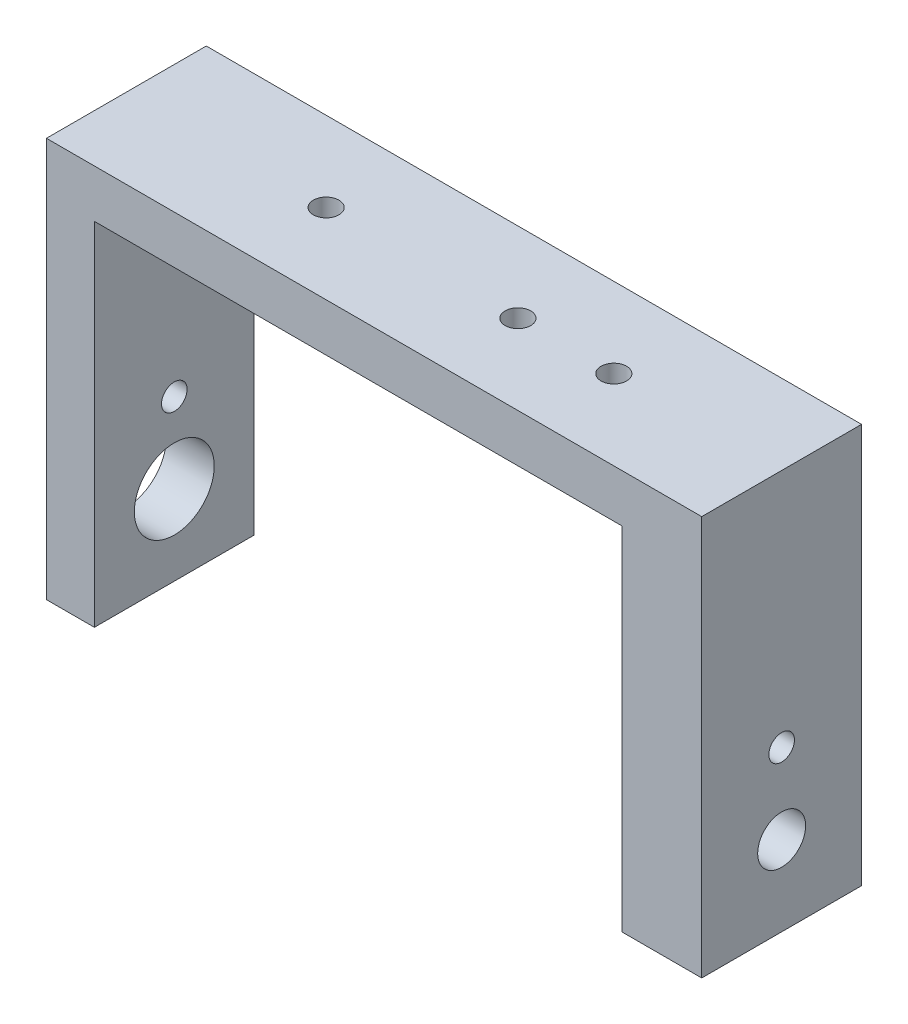
ISO-10303-21;
HEADER;
FILE_DESCRIPTION(('STEP AP214'),'2;1');
FILE_NAME('part.step','',(''),(''),'','','');
FILE_SCHEMA(('AUTOMOTIVE_DESIGN { 1 0 10303 214 1 1 1 1 }'));
ENDSEC;
DATA;
#1=APPLICATION_CONTEXT('core data for automotive mechanical design processes');
#2=APPLICATION_PROTOCOL_DEFINITION('international standard','automotive_design',2000,#1);
#3=PRODUCT_CONTEXT('',#1,'mechanical');
#4=PRODUCT('Part','Part','',(#3));
#5=PRODUCT_RELATED_PRODUCT_CATEGORY('part','',(#4));
#6=PRODUCT_DEFINITION_FORMATION('','',#4);
#7=PRODUCT_DEFINITION_CONTEXT('part definition',#1,'design');
#8=PRODUCT_DEFINITION('design','',#6,#7);
#9=PRODUCT_DEFINITION_SHAPE('','',#8);
#10=(LENGTH_UNIT() NAMED_UNIT(*) SI_UNIT(.MILLI.,.METRE.));
#11=(NAMED_UNIT(*) PLANE_ANGLE_UNIT() SI_UNIT($,.RADIAN.));
#12=(NAMED_UNIT(*) SI_UNIT($,.STERADIAN.) SOLID_ANGLE_UNIT());
#13=UNCERTAINTY_MEASURE_WITH_UNIT(LENGTH_MEASURE(1.E-05),#10,'distance_accuracy_value','');
#14=(GEOMETRIC_REPRESENTATION_CONTEXT(3) GLOBAL_UNCERTAINTY_ASSIGNED_CONTEXT((#13)) GLOBAL_UNIT_ASSIGNED_CONTEXT((#10,
#11,#12)) REPRESENTATION_CONTEXT('',''));
#15=CARTESIAN_POINT('',(0.,0.,0.));
#16=DIRECTION('',(0.,0.,1.));
#17=DIRECTION('',(1.,0.,0.));
#18=AXIS2_PLACEMENT_3D('',#15,#16,#17);
#19=CARTESIAN_POINT('',(16.5,-11.,10.));
#20=DIRECTION('',(1.,0.,0.));
#21=DIRECTION('',(0.,0.,-1.));
#22=AXIS2_PLACEMENT_3D('',#19,#20,#21);
#23=PLANE('',#22);
#24=DIRECTION('',(0.,0.,-1.));
#25=VECTOR('',#24,1.);
#26=CARTESIAN_POINT('',(16.5,-11.,10.));
#27=LINE('',#26,#25);
#28=CARTESIAN_POINT('',(16.5,-11.,1.));
#29=VERTEX_POINT('',#28);
#30=CARTESIAN_POINT('',(16.5,-11.,0.));
#31=VERTEX_POINT('',#30);
#32=EDGE_CURVE('E169',#29,#31,#27,.T.);
#33=ORIENTED_EDGE('',*,*,#32,.F.);
#34=DIRECTION('',(0.,-1.,0.));
#35=VECTOR('',#34,1.);
#36=CARTESIAN_POINT('',(16.5,-0.999999999999996,0.999999999999999));
#37=LINE('',#36,#35);
#38=CARTESIAN_POINT('',(16.5,-0.999999999999996,0.999999999999999));
#39=VERTEX_POINT('',#38);
#40=EDGE_CURVE('E262',#39,#29,#37,.T.);
#41=ORIENTED_EDGE('',*,*,#40,.F.);
#42=DIRECTION('',(0.,-0.988371697650617,-0.152057184253941));
#43=VECTOR('',#42,1.);
#44=CARTESIAN_POINT('',(16.5,12.,3.));
#45=LINE('',#44,#43);
#46=CARTESIAN_POINT('',(16.5,11.,2.84615384615384));
#47=VERTEX_POINT('',#46);
#48=EDGE_CURVE('E187',#47,#39,#45,.T.);
#49=ORIENTED_EDGE('',*,*,#48,.F.);
#50=DIRECTION('',(0.,0.,-1.));
#51=VECTOR('',#50,1.);
#52=CARTESIAN_POINT('',(16.5,11.,10.));
#53=LINE('',#52,#51);
#54=CARTESIAN_POINT('',(16.5,11.,0.));
#55=VERTEX_POINT('',#54);
#56=EDGE_CURVE('E173',#47,#55,#53,.T.);
#57=ORIENTED_EDGE('',*,*,#56,.T.);
#58=DIRECTION('',(0.,-1.,0.));
#59=VECTOR('',#58,1.);
#60=CARTESIAN_POINT('',(16.5,-11.,0.));
#61=LINE('',#60,#59);
#62=EDGE_CURVE('E151',#55,#31,#61,.T.);
#63=ORIENTED_EDGE('',*,*,#62,.T.);
#64=EDGE_LOOP('',(#33,#41,#49,#57,#63));
#65=FACE_BOUND('',#64,.T.);
#66=ADVANCED_FACE('F35',(#65),#23,.F.);
#67=CARTESIAN_POINT('',(-16.5,11.,10.));
#68=DIRECTION('',(-1.,0.,0.));
#69=DIRECTION('',(0.,0.,1.));
#70=AXIS2_PLACEMENT_3D('',#67,#68,#69);
#71=PLANE('',#70);
#72=CARTESIAN_POINT('',(-16.5,-6.,5.));
#73=DIRECTION('',(-1.,0.,0.));
#74=DIRECTION('',(0.,0.,1.));
#75=AXIS2_PLACEMENT_3D('',#72,#73,#74);
#76=CIRCLE('',#75,2.5);
#77=CARTESIAN_POINT('',(-16.5,-6.,7.5));
#78=VERTEX_POINT('',#77);
#79=EDGE_CURVE('E279',#78,#78,#76,.T.);
#80=ORIENTED_EDGE('',*,*,#79,.T.);
#81=EDGE_LOOP('',(#80));
#82=FACE_BOUND('',#81,.T.);
#83=CARTESIAN_POINT('',(-16.5,-0.999999999999994,5.));
#84=DIRECTION('',(-1.,0.,0.));
#85=DIRECTION('',(0.,0.,1.));
#86=AXIS2_PLACEMENT_3D('',#83,#84,#85);
#87=CIRCLE('',#86,0.800000000000001);
#88=CARTESIAN_POINT('',(-16.5,-0.999999999999994,5.8));
#89=VERTEX_POINT('',#88);
#90=EDGE_CURVE('E212',#89,#89,#87,.T.);
#91=ORIENTED_EDGE('',*,*,#90,.T.);
#92=EDGE_LOOP('',(#91));
#93=FACE_BOUND('',#92,.T.);
#94=DIRECTION('',(0.,1.,0.));
#95=VECTOR('',#94,1.);
#96=CARTESIAN_POINT('',(-16.5,11.,0.));
#97=LINE('',#96,#95);
#98=CARTESIAN_POINT('',(-16.5,-11.,0.));
#99=VERTEX_POINT('',#98);
#100=CARTESIAN_POINT('',(-16.5,11.,0.));
#101=VERTEX_POINT('',#100);
#102=EDGE_CURVE('E144',#99,#101,#97,.T.);
#103=ORIENTED_EDGE('',*,*,#102,.T.);
#104=DIRECTION('',(0.,0.,-1.));
#105=VECTOR('',#104,1.);
#106=CARTESIAN_POINT('',(-16.5,11.,10.));
#107=LINE('',#106,#105);
#108=CARTESIAN_POINT('',(-16.5,11.,10.));
#109=VERTEX_POINT('',#108);
#110=EDGE_CURVE('E11',#109,#101,#107,.T.);
#111=ORIENTED_EDGE('',*,*,#110,.F.);
#112=DIRECTION('',(0.,1.,0.));
#113=VECTOR('',#112,1.);
#114=CARTESIAN_POINT('',(-16.5,11.,10.));
#115=LINE('',#114,#113);
#116=CARTESIAN_POINT('',(-16.5,-11.,10.));
#117=VERTEX_POINT('',#116);
#118=EDGE_CURVE('E162',#117,#109,#115,.T.);
#119=ORIENTED_EDGE('',*,*,#118,.F.);
#120=DIRECTION('',(0.,0.,-1.));
#121=VECTOR('',#120,1.);
#122=CARTESIAN_POINT('',(-16.5,-11.,10.));
#123=LINE('',#122,#121);
#124=EDGE_CURVE('E140',#117,#99,#123,.T.);
#125=ORIENTED_EDGE('',*,*,#124,.T.);
#126=EDGE_LOOP('',(#103,#111,#119,#125));
#127=FACE_BOUND('',#126,.T.);
#128=ADVANCED_FACE('F37',(#82,#93,#127),#71,.F.);
#129=CARTESIAN_POINT('',(16.5,11.,10.));
#130=DIRECTION('',(0.,1.,0.));
#131=DIRECTION('',(0.,0.,1.));
#132=AXIS2_PLACEMENT_3D('',#129,#130,#131);
#133=PLANE('',#132);
#134=CARTESIAN_POINT('',(11.,11.,5.));
#135=DIRECTION('',(0.,1.,0.));
#136=DIRECTION('',(0.,0.,1.));
#137=AXIS2_PLACEMENT_3D('',#134,#135,#136);
#138=CIRCLE('',#137,0.800000000000001);
#139=CARTESIAN_POINT('',(11.,11.,5.8));
#140=VERTEX_POINT('',#139);
#141=EDGE_CURVE('E227',#140,#140,#138,.T.);
#142=ORIENTED_EDGE('',*,*,#141,.T.);
#143=EDGE_LOOP('',(#142));
#144=FACE_BOUND('',#143,.T.);
#145=CARTESIAN_POINT('',(5.,11.,5.));
#146=DIRECTION('',(0.,1.,0.));
#147=DIRECTION('',(0.,0.,1.));
#148=AXIS2_PLACEMENT_3D('',#145,#146,#147);
#149=CIRCLE('',#148,0.800000000000001);
#150=CARTESIAN_POINT('',(5.,11.,5.8));
#151=VERTEX_POINT('',#150);
#152=EDGE_CURVE('E230',#151,#151,#149,.T.);
#153=ORIENTED_EDGE('',*,*,#152,.T.);
#154=EDGE_LOOP('',(#153));
#155=FACE_BOUND('',#154,.T.);
#156=CARTESIAN_POINT('',(-7.,11.,5.));
#157=DIRECTION('',(0.,1.,0.));
#158=DIRECTION('',(0.,0.,1.));
#159=AXIS2_PLACEMENT_3D('',#156,#157,#158);
#160=CIRCLE('',#159,0.800000000000001);
#161=CARTESIAN_POINT('',(-7.,11.,5.8));
#162=VERTEX_POINT('',#161);
#163=EDGE_CURVE('E219',#162,#162,#160,.T.);
#164=ORIENTED_EDGE('',*,*,#163,.T.);
#165=EDGE_LOOP('',(#164));
#166=FACE_BOUND('',#165,.T.);
#167=DIRECTION('',(1.,0.,0.));
#168=VECTOR('',#167,1.);
#169=CARTESIAN_POINT('',(16.5,11.,0.));
#170=LINE('',#169,#168);
#171=EDGE_CURVE('E147',#101,#55,#170,.T.);
#172=ORIENTED_EDGE('',*,*,#171,.T.);
#173=ORIENTED_EDGE('',*,*,#56,.F.);
#174=DIRECTION('',(0.,0.,-1.));
#175=VECTOR('',#174,1.);
#176=CARTESIAN_POINT('',(16.5,11.,10.));
#177=LINE('',#176,#175);
#178=CARTESIAN_POINT('',(16.5,11.,7.15384615384615));
#179=VERTEX_POINT('',#178);
#180=EDGE_CURVE('E242',#179,#47,#177,.T.);
#181=ORIENTED_EDGE('',*,*,#180,.F.);
#182=CARTESIAN_POINT('',(16.5,11.,10.));
#183=VERTEX_POINT('',#182);
#184=EDGE_CURVE('E44',#183,#179,#53,.T.);
#185=ORIENTED_EDGE('',*,*,#184,.F.);
#186=DIRECTION('',(1.,0.,0.));
#187=VECTOR('',#186,1.);
#188=CARTESIAN_POINT('',(16.5,11.,10.));
#189=LINE('',#188,#187);
#190=EDGE_CURVE('E101',#109,#183,#189,.T.);
#191=ORIENTED_EDGE('',*,*,#190,.F.);
#192=ORIENTED_EDGE('',*,*,#110,.T.);
#193=EDGE_LOOP('',(#172,#173,#181,#185,#191,#192));
#194=FACE_BOUND('',#193,.T.);
#195=ADVANCED_FACE('F189',(#144,#155,#166,#194),#133,.F.);
#196=ORIENTED_EDGE('',*,*,#184,.T.);
#197=DIRECTION('',(0.,0.988371697650617,-0.152057184253941));
#198=VECTOR('',#197,1.);
#199=CARTESIAN_POINT('',(16.5,12.,7.));
#200=LINE('',#199,#198);
#201=CARTESIAN_POINT('',(16.5,-0.999999999999996,9.));
#202=VERTEX_POINT('',#201);
#203=EDGE_CURVE('E272',#202,#179,#200,.T.);
#204=ORIENTED_EDGE('',*,*,#203,.F.);
#205=DIRECTION('',(0.,1.,0.));
#206=VECTOR('',#205,1.);
#207=CARTESIAN_POINT('',(16.5,-0.999999999999996,9.));
#208=LINE('',#207,#206);
#209=CARTESIAN_POINT('',(16.5,-11.,9.));
#210=VERTEX_POINT('',#209);
#211=EDGE_CURVE('E276',#210,#202,#208,.T.);
#212=ORIENTED_EDGE('',*,*,#211,.F.);
#213=CARTESIAN_POINT('',(16.5,-11.,10.));
#214=VERTEX_POINT('',#213);
#215=EDGE_CURVE('E170',#214,#210,#27,.T.);
#216=ORIENTED_EDGE('',*,*,#215,.F.);
#217=DIRECTION('',(0.,-1.,0.));
#218=VECTOR('',#217,1.);
#219=CARTESIAN_POINT('',(16.5,-11.,10.));
#220=LINE('',#219,#218);
#221=EDGE_CURVE('E204',#183,#214,#220,.T.);
#222=ORIENTED_EDGE('',*,*,#221,.F.);
#223=EDGE_LOOP('',(#196,#204,#212,#216,#222));
#224=FACE_BOUND('',#223,.T.);
#225=ADVANCED_FACE('F321',(#224),#23,.F.);
#226=CARTESIAN_POINT('',(16.5,-11.,10.));
#227=DIRECTION('',(0.,1.,0.));
#228=DIRECTION('',(-1.,0.,0.));
#229=AXIS2_PLACEMENT_3D('',#226,#227,#228);
#230=PLANE('',#229);
#231=DIRECTION('',(0.,0.,1.));
#232=VECTOR('',#231,1.);
#233=CARTESIAN_POINT('',(18.5,-11.,1.));
#234=LINE('',#233,#232);
#235=CARTESIAN_POINT('',(18.5,-11.,0.999999999999999));
#236=VERTEX_POINT('',#235);
#237=CARTESIAN_POINT('',(18.5,-11.,9.));
#238=VERTEX_POINT('',#237);
#239=EDGE_CURVE('E265',#236,#238,#234,.T.);
#240=ORIENTED_EDGE('',*,*,#239,.F.);
#241=DIRECTION('',(-1.,0.,0.));
#242=VECTOR('',#241,1.);
#243=CARTESIAN_POINT('',(18.5,-11.,1.));
#244=LINE('',#243,#242);
#245=EDGE_CURVE('E245',#236,#29,#244,.T.);
#246=ORIENTED_EDGE('',*,*,#245,.T.);
#247=ORIENTED_EDGE('',*,*,#32,.T.);
#248=DIRECTION('',(1.,0.,0.));
#249=VECTOR('',#248,1.);
#250=CARTESIAN_POINT('',(16.5,-11.,0.));
#251=LINE('',#250,#249);
#252=CARTESIAN_POINT('',(21.5,-11.,0.));
#253=VERTEX_POINT('',#252);
#254=EDGE_CURVE('E154',#31,#253,#251,.T.);
#255=ORIENTED_EDGE('',*,*,#254,.T.);
#256=DIRECTION('',(0.,0.,-1.));
#257=VECTOR('',#256,1.);
#258=CARTESIAN_POINT('',(21.5,-11.,10.));
#259=LINE('',#258,#257);
#260=CARTESIAN_POINT('',(21.5,-11.,10.));
#261=VERTEX_POINT('',#260);
#262=EDGE_CURVE('E166',#261,#253,#259,.T.);
#263=ORIENTED_EDGE('',*,*,#262,.F.);
#264=DIRECTION('',(1.,0.,0.));
#265=VECTOR('',#264,1.);
#266=CARTESIAN_POINT('',(16.5,-11.,10.));
#267=LINE('',#266,#265);
#268=EDGE_CURVE('E203',#214,#261,#267,.T.);
#269=ORIENTED_EDGE('',*,*,#268,.F.);
#270=ORIENTED_EDGE('',*,*,#215,.T.);
#271=DIRECTION('',(-1.,0.,0.));
#272=VECTOR('',#271,1.);
#273=CARTESIAN_POINT('',(18.5,-11.,9.));
#274=LINE('',#273,#272);
#275=EDGE_CURVE('E246',#238,#210,#274,.T.);
#276=ORIENTED_EDGE('',*,*,#275,.F.);
#277=EDGE_LOOP('',(#240,#246,#247,#255,#263,#269,#270,#276));
#278=FACE_BOUND('',#277,.T.);
#279=ADVANCED_FACE('F198',(#278),#230,.F.);
#280=CARTESIAN_POINT('',(21.5,-11.,10.));
#281=DIRECTION('',(-1.,0.,0.));
#282=DIRECTION('',(0.,0.,1.));
#283=AXIS2_PLACEMENT_3D('',#280,#281,#282);
#284=PLANE('',#283);
#285=CARTESIAN_POINT('',(21.5,-0.999999999999994,5.));
#286=DIRECTION('',(-1.,0.,0.));
#287=DIRECTION('',(0.,0.,1.));
#288=AXIS2_PLACEMENT_3D('',#285,#286,#287);
#289=CIRCLE('',#288,0.800000000000001);
#290=CARTESIAN_POINT('',(21.5,-0.999999999999994,5.8));
#291=VERTEX_POINT('',#290);
#292=EDGE_CURVE('E215',#291,#291,#289,.T.);
#293=ORIENTED_EDGE('',*,*,#292,.T.);
#294=EDGE_LOOP('',(#293));
#295=FACE_BOUND('',#294,.T.);
#296=CARTESIAN_POINT('',(21.5,-6.,5.));
#297=DIRECTION('',(-1.,0.,0.));
#298=DIRECTION('',(0.,0.,1.));
#299=AXIS2_PLACEMENT_3D('',#296,#297,#298);
#300=CIRCLE('',#299,1.5);
#301=CARTESIAN_POINT('',(21.5,-6.,6.5));
#302=VERTEX_POINT('',#301);
#303=EDGE_CURVE('E148',#302,#302,#300,.T.);
#304=ORIENTED_EDGE('',*,*,#303,.T.);
#305=EDGE_LOOP('',(#304));
#306=FACE_BOUND('',#305,.T.);
#307=DIRECTION('',(0.,1.,0.));
#308=VECTOR('',#307,1.);
#309=CARTESIAN_POINT('',(21.5,-11.,0.));
#310=LINE('',#309,#308);
#311=CARTESIAN_POINT('',(21.5,14.,0.));
#312=VERTEX_POINT('',#311);
#313=EDGE_CURVE('E156',#253,#312,#310,.T.);
#314=ORIENTED_EDGE('',*,*,#313,.T.);
#315=DIRECTION('',(0.,0.,-1.));
#316=VECTOR('',#315,1.);
#317=CARTESIAN_POINT('',(21.5,14.,10.));
#318=LINE('',#317,#316);
#319=CARTESIAN_POINT('',(21.5,14.,10.));
#320=VERTEX_POINT('',#319);
#321=EDGE_CURVE('E135',#320,#312,#318,.T.);
#322=ORIENTED_EDGE('',*,*,#321,.F.);
#323=DIRECTION('',(0.,1.,0.));
#324=VECTOR('',#323,1.);
#325=CARTESIAN_POINT('',(21.5,-11.,10.));
#326=LINE('',#325,#324);
#327=EDGE_CURVE('E123',#261,#320,#326,.T.);
#328=ORIENTED_EDGE('',*,*,#327,.F.);
#329=ORIENTED_EDGE('',*,*,#262,.T.);
#330=EDGE_LOOP('',(#314,#322,#328,#329));
#331=FACE_BOUND('',#330,.T.);
#332=ADVANCED_FACE('F202',(#295,#306,#331),#284,.F.);
#333=CARTESIAN_POINT('',(21.5,14.,10.));
#334=DIRECTION('',(0.,-1.,0.));
#335=DIRECTION('',(0.,0.,-1.));
#336=AXIS2_PLACEMENT_3D('',#333,#334,#335);
#337=PLANE('',#336);
#338=CARTESIAN_POINT('',(11.,14.,5.));
#339=DIRECTION('',(0.,1.,0.));
#340=DIRECTION('',(0.,0.,1.));
#341=AXIS2_PLACEMENT_3D('',#338,#339,#340);
#342=CIRCLE('',#341,0.800000000000001);
#343=CARTESIAN_POINT('',(11.,14.,5.8));
#344=VERTEX_POINT('',#343);
#345=EDGE_CURVE('E233',#344,#344,#342,.T.);
#346=ORIENTED_EDGE('',*,*,#345,.F.);
#347=EDGE_LOOP('',(#346));
#348=FACE_BOUND('',#347,.T.);
#349=CARTESIAN_POINT('',(5.,14.,5.));
#350=DIRECTION('',(0.,1.,0.));
#351=DIRECTION('',(0.,0.,1.));
#352=AXIS2_PLACEMENT_3D('',#349,#350,#351);
#353=CIRCLE('',#352,0.800000000000001);
#354=CARTESIAN_POINT('',(5.,14.,5.8));
#355=VERTEX_POINT('',#354);
#356=EDGE_CURVE('E234',#355,#355,#353,.T.);
#357=ORIENTED_EDGE('',*,*,#356,.F.);
#358=EDGE_LOOP('',(#357));
#359=FACE_BOUND('',#358,.T.);
#360=CARTESIAN_POINT('',(-7.,14.,5.));
#361=DIRECTION('',(0.,1.,0.));
#362=DIRECTION('',(0.,0.,1.));
#363=AXIS2_PLACEMENT_3D('',#360,#361,#362);
#364=CIRCLE('',#363,0.800000000000001);
#365=CARTESIAN_POINT('',(-7.,14.,5.8));
#366=VERTEX_POINT('',#365);
#367=EDGE_CURVE('E224',#366,#366,#364,.T.);
#368=ORIENTED_EDGE('',*,*,#367,.F.);
#369=EDGE_LOOP('',(#368));
#370=FACE_BOUND('',#369,.T.);
#371=DIRECTION('',(-1.,0.,0.));
#372=VECTOR('',#371,1.);
#373=CARTESIAN_POINT('',(21.5,14.,0.));
#374=LINE('',#373,#372);
#375=CARTESIAN_POINT('',(-19.5,14.,0.));
#376=VERTEX_POINT('',#375);
#377=EDGE_CURVE('E132',#312,#376,#374,.T.);
#378=ORIENTED_EDGE('',*,*,#377,.T.);
#379=DIRECTION('',(0.,0.,-1.));
#380=VECTOR('',#379,1.);
#381=CARTESIAN_POINT('',(-19.5,14.,10.));
#382=LINE('',#381,#380);
#383=CARTESIAN_POINT('',(-19.5,14.,10.));
#384=VERTEX_POINT('',#383);
#385=EDGE_CURVE('E129',#384,#376,#382,.T.);
#386=ORIENTED_EDGE('',*,*,#385,.F.);
#387=DIRECTION('',(-1.,0.,0.));
#388=VECTOR('',#387,1.);
#389=CARTESIAN_POINT('',(21.5,14.,10.));
#390=LINE('',#389,#388);
#391=EDGE_CURVE('E116',#320,#384,#390,.T.);
#392=ORIENTED_EDGE('',*,*,#391,.F.);
#393=ORIENTED_EDGE('',*,*,#321,.T.);
#394=EDGE_LOOP('',(#378,#386,#392,#393));
#395=FACE_BOUND('',#394,.T.);
#396=ADVANCED_FACE('F130',(#348,#359,#370,#395),#337,.F.);
#397=CARTESIAN_POINT('',(-19.5,-11.,10.));
#398=DIRECTION('',(1.,0.,0.));
#399=DIRECTION('',(0.,0.,-1.));
#400=AXIS2_PLACEMENT_3D('',#397,#398,#399);
#401=PLANE('',#400);
#402=CARTESIAN_POINT('',(-19.5,-6.,5.));
#403=DIRECTION('',(-1.,0.,0.));
#404=DIRECTION('',(0.,0.,1.));
#405=AXIS2_PLACEMENT_3D('',#402,#403,#404);
#406=CIRCLE('',#405,2.5);
#407=CARTESIAN_POINT('',(-19.5,-6.,7.5));
#408=VERTEX_POINT('',#407);
#409=EDGE_CURVE('E295',#408,#408,#406,.T.);
#410=ORIENTED_EDGE('',*,*,#409,.F.);
#411=EDGE_LOOP('',(#410));
#412=FACE_BOUND('',#411,.T.);
#413=CARTESIAN_POINT('',(-19.5,-0.999999999999994,5.));
#414=DIRECTION('',(-1.,0.,0.));
#415=DIRECTION('',(0.,0.,1.));
#416=AXIS2_PLACEMENT_3D('',#413,#414,#415);
#417=CIRCLE('',#416,0.800000000000001);
#418=CARTESIAN_POINT('',(-19.5,-0.999999999999994,5.8));
#419=VERTEX_POINT('',#418);
#420=EDGE_CURVE('E216',#419,#419,#417,.T.);
#421=ORIENTED_EDGE('',*,*,#420,.F.);
#422=EDGE_LOOP('',(#421));
#423=FACE_BOUND('',#422,.T.);
#424=DIRECTION('',(0.,-1.,0.));
#425=VECTOR('',#424,1.);
#426=CARTESIAN_POINT('',(-19.5,-11.,0.));
#427=LINE('',#426,#425);
#428=CARTESIAN_POINT('',(-19.5,-11.,0.));
#429=VERTEX_POINT('',#428);
#430=EDGE_CURVE('E159',#376,#429,#427,.T.);
#431=ORIENTED_EDGE('',*,*,#430,.T.);
#432=DIRECTION('',(0.,0.,-1.));
#433=VECTOR('',#432,1.);
#434=CARTESIAN_POINT('',(-19.5,-11.,10.));
#435=LINE('',#434,#433);
#436=CARTESIAN_POINT('',(-19.5,-11.,10.));
#437=VERTEX_POINT('',#436);
#438=EDGE_CURVE('E136',#437,#429,#435,.T.);
#439=ORIENTED_EDGE('',*,*,#438,.F.);
#440=DIRECTION('',(0.,-1.,0.));
#441=VECTOR('',#440,1.);
#442=CARTESIAN_POINT('',(-19.5,-11.,10.));
#443=LINE('',#442,#441);
#444=EDGE_CURVE('E120',#384,#437,#443,.T.);
#445=ORIENTED_EDGE('',*,*,#444,.F.);
#446=ORIENTED_EDGE('',*,*,#385,.T.);
#447=EDGE_LOOP('',(#431,#439,#445,#446));
#448=FACE_BOUND('',#447,.T.);
#449=ADVANCED_FACE('F138',(#412,#423,#448),#401,.F.);
#450=CARTESIAN_POINT('',(-16.5,-11.,10.));
#451=DIRECTION('',(0.,1.,0.));
#452=DIRECTION('',(0.,0.,1.));
#453=AXIS2_PLACEMENT_3D('',#450,#451,#452);
#454=PLANE('',#453);
#455=DIRECTION('',(1.,0.,0.));
#456=VECTOR('',#455,1.);
#457=CARTESIAN_POINT('',(-16.5,-11.,0.));
#458=LINE('',#457,#456);
#459=EDGE_CURVE('E93',#429,#99,#458,.T.);
#460=ORIENTED_EDGE('',*,*,#459,.T.);
#461=ORIENTED_EDGE('',*,*,#124,.F.);
#462=DIRECTION('',(1.,0.,0.));
#463=VECTOR('',#462,1.);
#464=CARTESIAN_POINT('',(-16.5,-11.,10.));
#465=LINE('',#464,#463);
#466=EDGE_CURVE('E60',#437,#117,#465,.T.);
#467=ORIENTED_EDGE('',*,*,#466,.F.);
#468=ORIENTED_EDGE('',*,*,#438,.T.);
#469=EDGE_LOOP('',(#460,#461,#467,#468));
#470=FACE_BOUND('',#469,.T.);
#471=ADVANCED_FACE('F304',(#470),#454,.F.);
#472=CARTESIAN_POINT('',(0.,0.,10.));
#473=DIRECTION('',(0.,0.,-1.));
#474=DIRECTION('',(-1.,0.,0.));
#475=AXIS2_PLACEMENT_3D('',#472,#473,#474);
#476=PLANE('',#475);
#477=ORIENTED_EDGE('',*,*,#118,.T.);
#478=ORIENTED_EDGE('',*,*,#190,.T.);
#479=ORIENTED_EDGE('',*,*,#221,.T.);
#480=ORIENTED_EDGE('',*,*,#268,.T.);
#481=ORIENTED_EDGE('',*,*,#327,.T.);
#482=ORIENTED_EDGE('',*,*,#391,.T.);
#483=ORIENTED_EDGE('',*,*,#444,.T.);
#484=ORIENTED_EDGE('',*,*,#466,.T.);
#485=EDGE_LOOP('',(#477,#478,#479,#480,#481,#482,#483,#484));
#486=FACE_BOUND('',#485,.T.);
#487=ADVANCED_FACE('F118',(#486),#476,.F.);
#488=CARTESIAN_POINT('',(0.,0.,0.));
#489=DIRECTION('',(0.,0.,-1.));
#490=DIRECTION('',(-1.,0.,0.));
#491=AXIS2_PLACEMENT_3D('',#488,#489,#490);
#492=PLANE('',#491);
#493=ORIENTED_EDGE('',*,*,#102,.F.);
#494=ORIENTED_EDGE('',*,*,#459,.F.);
#495=ORIENTED_EDGE('',*,*,#430,.F.);
#496=ORIENTED_EDGE('',*,*,#377,.F.);
#497=ORIENTED_EDGE('',*,*,#313,.F.);
#498=ORIENTED_EDGE('',*,*,#254,.F.);
#499=ORIENTED_EDGE('',*,*,#62,.F.);
#500=ORIENTED_EDGE('',*,*,#171,.F.);
#501=EDGE_LOOP('',(#493,#494,#495,#496,#497,#498,#499,#500));
#502=FACE_BOUND('',#501,.T.);
#503=ADVANCED_FACE('F193',(#502),#492,.T.);
#504=CARTESIAN_POINT('',(21.5,-6.,5.));
#505=DIRECTION('',(-1.,0.,0.));
#506=DIRECTION('',(0.,0.,1.));
#507=AXIS2_PLACEMENT_3D('',#504,#505,#506);
#508=CYLINDRICAL_SURFACE('',#507,1.5);
#509=CARTESIAN_POINT('',(18.5,-6.,5.));
#510=DIRECTION('',(1.,0.,0.));
#511=DIRECTION('',(0.,0.,-1.));
#512=AXIS2_PLACEMENT_3D('',#509,#510,#511);
#513=CIRCLE('',#512,1.5);
#514=CARTESIAN_POINT('',(18.5,-6.,3.5));
#515=VERTEX_POINT('',#514);
#516=EDGE_CURVE('E237',#515,#515,#513,.F.);
#517=ORIENTED_EDGE('',*,*,#516,.T.);
#518=EDGE_LOOP('',(#517));
#519=FACE_BOUND('',#518,.T.);
#520=ORIENTED_EDGE('',*,*,#303,.F.);
#521=EDGE_LOOP('',(#520));
#522=FACE_BOUND('',#521,.T.);
#523=ADVANCED_FACE('F312',(#519,#522),#508,.F.);
#524=CARTESIAN_POINT('',(21.5,-0.999999999999994,5.));
#525=DIRECTION('',(-1.,0.,0.));
#526=DIRECTION('',(0.,0.,1.));
#527=AXIS2_PLACEMENT_3D('',#524,#525,#526);
#528=CYLINDRICAL_SURFACE('',#527,0.800000000000001);
#529=ORIENTED_EDGE('',*,*,#420,.T.);
#530=EDGE_LOOP('',(#529));
#531=FACE_BOUND('',#530,.T.);
#532=ORIENTED_EDGE('',*,*,#90,.F.);
#533=EDGE_LOOP('',(#532));
#534=FACE_BOUND('',#533,.T.);
#535=ADVANCED_FACE('F308',(#531,#534),#528,.F.);
#536=CARTESIAN_POINT('',(18.5,-0.999999999999994,5.));
#537=DIRECTION('',(1.,0.,0.));
#538=DIRECTION('',(0.,0.,-1.));
#539=AXIS2_PLACEMENT_3D('',#536,#537,#538);
#540=CIRCLE('',#539,0.800000000000001);
#541=CARTESIAN_POINT('',(18.5,-0.999999999999994,4.2));
#542=VERTEX_POINT('',#541);
#543=EDGE_CURVE('E39',#542,#542,#540,.F.);
#544=ORIENTED_EDGE('',*,*,#543,.T.);
#545=EDGE_LOOP('',(#544));
#546=FACE_BOUND('',#545,.T.);
#547=ORIENTED_EDGE('',*,*,#292,.F.);
#548=EDGE_LOOP('',(#547));
#549=FACE_BOUND('',#548,.T.);
#550=ADVANCED_FACE('F311',(#546,#549),#528,.F.);
#551=CARTESIAN_POINT('',(-7.,-11.,5.));
#552=DIRECTION('',(0.,1.,0.));
#553=DIRECTION('',(0.,0.,1.));
#554=AXIS2_PLACEMENT_3D('',#551,#552,#553);
#555=CYLINDRICAL_SURFACE('',#554,0.800000000000001);
#556=ORIENTED_EDGE('',*,*,#367,.T.);
#557=EDGE_LOOP('',(#556));
#558=FACE_BOUND('',#557,.T.);
#559=ORIENTED_EDGE('',*,*,#163,.F.);
#560=EDGE_LOOP('',(#559));
#561=FACE_BOUND('',#560,.T.);
#562=ADVANCED_FACE('F396',(#558,#561),#555,.F.);
#563=CARTESIAN_POINT('',(5.,-11.,5.));
#564=DIRECTION('',(0.,1.,0.));
#565=DIRECTION('',(0.,0.,1.));
#566=AXIS2_PLACEMENT_3D('',#563,#564,#565);
#567=CYLINDRICAL_SURFACE('',#566,0.800000000000001);
#568=ORIENTED_EDGE('',*,*,#356,.T.);
#569=EDGE_LOOP('',(#568));
#570=FACE_BOUND('',#569,.T.);
#571=ORIENTED_EDGE('',*,*,#152,.F.);
#572=EDGE_LOOP('',(#571));
#573=FACE_BOUND('',#572,.T.);
#574=ADVANCED_FACE('F398',(#570,#573),#567,.F.);
#575=CARTESIAN_POINT('',(11.,-11.,5.));
#576=DIRECTION('',(0.,1.,0.));
#577=DIRECTION('',(0.,0.,1.));
#578=AXIS2_PLACEMENT_3D('',#575,#576,#577);
#579=CYLINDRICAL_SURFACE('',#578,0.800000000000001);
#580=ORIENTED_EDGE('',*,*,#345,.T.);
#581=EDGE_LOOP('',(#580));
#582=FACE_BOUND('',#581,.T.);
#583=ORIENTED_EDGE('',*,*,#141,.F.);
#584=EDGE_LOOP('',(#583));
#585=FACE_BOUND('',#584,.T.);
#586=ADVANCED_FACE('F405',(#582,#585),#579,.F.);
#587=CARTESIAN_POINT('',(18.5,0.,0.));
#588=DIRECTION('',(1.,0.,0.));
#589=DIRECTION('',(0.,0.,-1.));
#590=AXIS2_PLACEMENT_3D('',#587,#588,#589);
#591=PLANE('',#590);
#592=ORIENTED_EDGE('',*,*,#543,.F.);
#593=EDGE_LOOP('',(#592));
#594=FACE_BOUND('',#593,.T.);
#595=ORIENTED_EDGE('',*,*,#239,.T.);
#596=DIRECTION('',(0.,1.,0.));
#597=VECTOR('',#596,1.);
#598=CARTESIAN_POINT('',(18.5,-0.999999999999996,9.));
#599=LINE('',#598,#597);
#600=CARTESIAN_POINT('',(18.5,-0.999999999999996,9.));
#601=VERTEX_POINT('',#600);
#602=EDGE_CURVE('E289',#238,#601,#599,.T.);
#603=ORIENTED_EDGE('',*,*,#602,.T.);
#604=DIRECTION('',(0.,0.988371697650617,-0.152057184253941));
#605=VECTOR('',#604,1.);
#606=CARTESIAN_POINT('',(18.5,12.,7.));
#607=LINE('',#606,#605);
#608=CARTESIAN_POINT('',(18.5,12.,7.));
#609=VERTEX_POINT('',#608);
#610=EDGE_CURVE('E286',#601,#609,#607,.T.);
#611=ORIENTED_EDGE('',*,*,#610,.T.);
#612=DIRECTION('',(0.,0.,-1.));
#613=VECTOR('',#612,1.);
#614=CARTESIAN_POINT('',(18.5,12.,3.));
#615=LINE('',#614,#613);
#616=CARTESIAN_POINT('',(18.5,12.,3.));
#617=VERTEX_POINT('',#616);
#618=EDGE_CURVE('E283',#609,#617,#615,.T.);
#619=ORIENTED_EDGE('',*,*,#618,.T.);
#620=DIRECTION('',(0.,-0.988371697650617,-0.152057184253941));
#621=VECTOR('',#620,1.);
#622=CARTESIAN_POINT('',(18.5,12.,3.));
#623=LINE('',#622,#621);
#624=CARTESIAN_POINT('',(18.5,-0.999999999999996,0.999999999999999));
#625=VERTEX_POINT('',#624);
#626=EDGE_CURVE('E281',#617,#625,#623,.T.);
#627=ORIENTED_EDGE('',*,*,#626,.T.);
#628=DIRECTION('',(0.,-1.,0.));
#629=VECTOR('',#628,1.);
#630=CARTESIAN_POINT('',(18.5,-0.999999999999996,0.999999999999999));
#631=LINE('',#630,#629);
#632=EDGE_CURVE('E51',#625,#236,#631,.T.);
#633=ORIENTED_EDGE('',*,*,#632,.T.);
#634=EDGE_LOOP('',(#595,#603,#611,#619,#627,#633));
#635=FACE_BOUND('',#634,.T.);
#636=ORIENTED_EDGE('',*,*,#516,.F.);
#637=EDGE_LOOP('',(#636));
#638=FACE_BOUND('',#637,.T.);
#639=ADVANCED_FACE('F362',(#594,#635,#638),#591,.F.);
#640=CARTESIAN_POINT('',(16.5,0.,0.));
#641=DIRECTION('',(1.,0.,0.));
#642=DIRECTION('',(0.,0.,-1.));
#643=AXIS2_PLACEMENT_3D('',#640,#641,#642);
#644=PLANE('',#643);
#645=ORIENTED_EDGE('',*,*,#180,.T.);
#646=CARTESIAN_POINT('',(16.5,12.,3.));
#647=VERTEX_POINT('',#646);
#648=EDGE_CURVE('E266',#647,#47,#45,.T.);
#649=ORIENTED_EDGE('',*,*,#648,.F.);
#650=DIRECTION('',(0.,0.,-1.));
#651=VECTOR('',#650,1.);
#652=CARTESIAN_POINT('',(16.5,12.,3.));
#653=LINE('',#652,#651);
#654=CARTESIAN_POINT('',(16.5,12.,7.));
#655=VERTEX_POINT('',#654);
#656=EDGE_CURVE('E269',#655,#647,#653,.T.);
#657=ORIENTED_EDGE('',*,*,#656,.F.);
#658=EDGE_CURVE('E275',#179,#655,#200,.T.);
#659=ORIENTED_EDGE('',*,*,#658,.F.);
#660=EDGE_LOOP('',(#645,#649,#657,#659));
#661=FACE_BOUND('',#660,.T.);
#662=ADVANCED_FACE('F368',(#661),#644,.T.);
#663=CARTESIAN_POINT('',(18.5,-0.999999999999996,0.999999999999999));
#664=DIRECTION('',(0.,0.,-1.));
#665=DIRECTION('',(0.,1.,0.));
#666=AXIS2_PLACEMENT_3D('',#663,#664,#665);
#667=PLANE('',#666);
#668=ORIENTED_EDGE('',*,*,#40,.T.);
#669=ORIENTED_EDGE('',*,*,#245,.F.);
#670=ORIENTED_EDGE('',*,*,#632,.F.);
#671=DIRECTION('',(-1.,0.,0.));
#672=VECTOR('',#671,1.);
#673=CARTESIAN_POINT('',(18.5,-0.999999999999996,0.999999999999999));
#674=LINE('',#673,#672);
#675=EDGE_CURVE('E258',#625,#39,#674,.T.);
#676=ORIENTED_EDGE('',*,*,#675,.T.);
#677=EDGE_LOOP('',(#668,#669,#670,#676));
#678=FACE_BOUND('',#677,.T.);
#679=ADVANCED_FACE('F365',(#678),#667,.F.);
#680=CARTESIAN_POINT('',(18.5,12.,3.));
#681=DIRECTION('',(0.,0.152057184253941,-0.988371697650617));
#682=DIRECTION('',(0.,0.988371697650617,0.152057184253941));
#683=AXIS2_PLACEMENT_3D('',#680,#681,#682);
#684=PLANE('',#683);
#685=ORIENTED_EDGE('',*,*,#648,.T.);
#686=ORIENTED_EDGE('',*,*,#48,.T.);
#687=ORIENTED_EDGE('',*,*,#675,.F.);
#688=ORIENTED_EDGE('',*,*,#626,.F.);
#689=DIRECTION('',(-1.,0.,0.));
#690=VECTOR('',#689,1.);
#691=CARTESIAN_POINT('',(18.5,12.,3.));
#692=LINE('',#691,#690);
#693=EDGE_CURVE('E255',#617,#647,#692,.T.);
#694=ORIENTED_EDGE('',*,*,#693,.T.);
#695=EDGE_LOOP('',(#685,#686,#687,#688,#694));
#696=FACE_BOUND('',#695,.T.);
#697=ADVANCED_FACE('F367',(#696),#684,.F.);
#698=CARTESIAN_POINT('',(18.5,12.,3.));
#699=DIRECTION('',(0.,1.,0.));
#700=DIRECTION('',(0.,0.,1.));
#701=AXIS2_PLACEMENT_3D('',#698,#699,#700);
#702=PLANE('',#701);
#703=ORIENTED_EDGE('',*,*,#656,.T.);
#704=ORIENTED_EDGE('',*,*,#693,.F.);
#705=ORIENTED_EDGE('',*,*,#618,.F.);
#706=DIRECTION('',(-1.,0.,0.));
#707=VECTOR('',#706,1.);
#708=CARTESIAN_POINT('',(18.5,12.,7.));
#709=LINE('',#708,#707);
#710=EDGE_CURVE('E252',#609,#655,#709,.T.);
#711=ORIENTED_EDGE('',*,*,#710,.T.);
#712=EDGE_LOOP('',(#703,#704,#705,#711));
#713=FACE_BOUND('',#712,.T.);
#714=ADVANCED_FACE('F374',(#713),#702,.F.);
#715=CARTESIAN_POINT('',(18.5,12.,7.));
#716=DIRECTION('',(0.,0.152057184253941,0.988371697650617));
#717=DIRECTION('',(0.,-0.988371697650617,0.152057184253941));
#718=AXIS2_PLACEMENT_3D('',#715,#716,#717);
#719=PLANE('',#718);
#720=ORIENTED_EDGE('',*,*,#203,.T.);
#721=ORIENTED_EDGE('',*,*,#658,.T.);
#722=ORIENTED_EDGE('',*,*,#710,.F.);
#723=ORIENTED_EDGE('',*,*,#610,.F.);
#724=DIRECTION('',(-1.,0.,0.));
#725=VECTOR('',#724,1.);
#726=CARTESIAN_POINT('',(18.5,-0.999999999999996,9.));
#727=LINE('',#726,#725);
#728=EDGE_CURVE('E249',#601,#202,#727,.T.);
#729=ORIENTED_EDGE('',*,*,#728,.T.);
#730=EDGE_LOOP('',(#720,#721,#722,#723,#729));
#731=FACE_BOUND('',#730,.T.);
#732=ADVANCED_FACE('F505',(#731),#719,.F.);
#733=CARTESIAN_POINT('',(18.5,-0.999999999999996,9.));
#734=DIRECTION('',(0.,0.,1.));
#735=DIRECTION('',(1.,0.,0.));
#736=AXIS2_PLACEMENT_3D('',#733,#734,#735);
#737=PLANE('',#736);
#738=ORIENTED_EDGE('',*,*,#211,.T.);
#739=ORIENTED_EDGE('',*,*,#728,.F.);
#740=ORIENTED_EDGE('',*,*,#602,.F.);
#741=ORIENTED_EDGE('',*,*,#275,.T.);
#742=EDGE_LOOP('',(#738,#739,#740,#741));
#743=FACE_BOUND('',#742,.T.);
#744=ADVANCED_FACE('F360',(#743),#737,.F.);
#745=CARTESIAN_POINT('',(-9.49999999999999,-6.,5.));
#746=DIRECTION('',(-1.,0.,0.));
#747=DIRECTION('',(0.,0.,1.));
#748=AXIS2_PLACEMENT_3D('',#745,#746,#747);
#749=CYLINDRICAL_SURFACE('',#748,2.5);
#750=ORIENTED_EDGE('',*,*,#409,.T.);
#751=EDGE_LOOP('',(#750));
#752=FACE_BOUND('',#751,.T.);
#753=ORIENTED_EDGE('',*,*,#79,.F.);
#754=EDGE_LOOP('',(#753));
#755=FACE_BOUND('',#754,.T.);
#756=ADVANCED_FACE('F299',(#752,#755),#749,.F.);
#757=CLOSED_SHELL('',(#66,#128,#195,#225,#279,#332,#396,#449,#471,#487,#503,#523,#535,#550,#562,
#574,#586,#639,#662,#679,#697,#714,#732,#744,#756));
#758=MANIFOLD_SOLID_BREP('B2',#757);
#759=ADVANCED_BREP_SHAPE_REPRESENTATION('',(#18,#758),#14);
#760=SHAPE_DEFINITION_REPRESENTATION(#9,#759);
ENDSEC;
END-ISO-10303-21;
